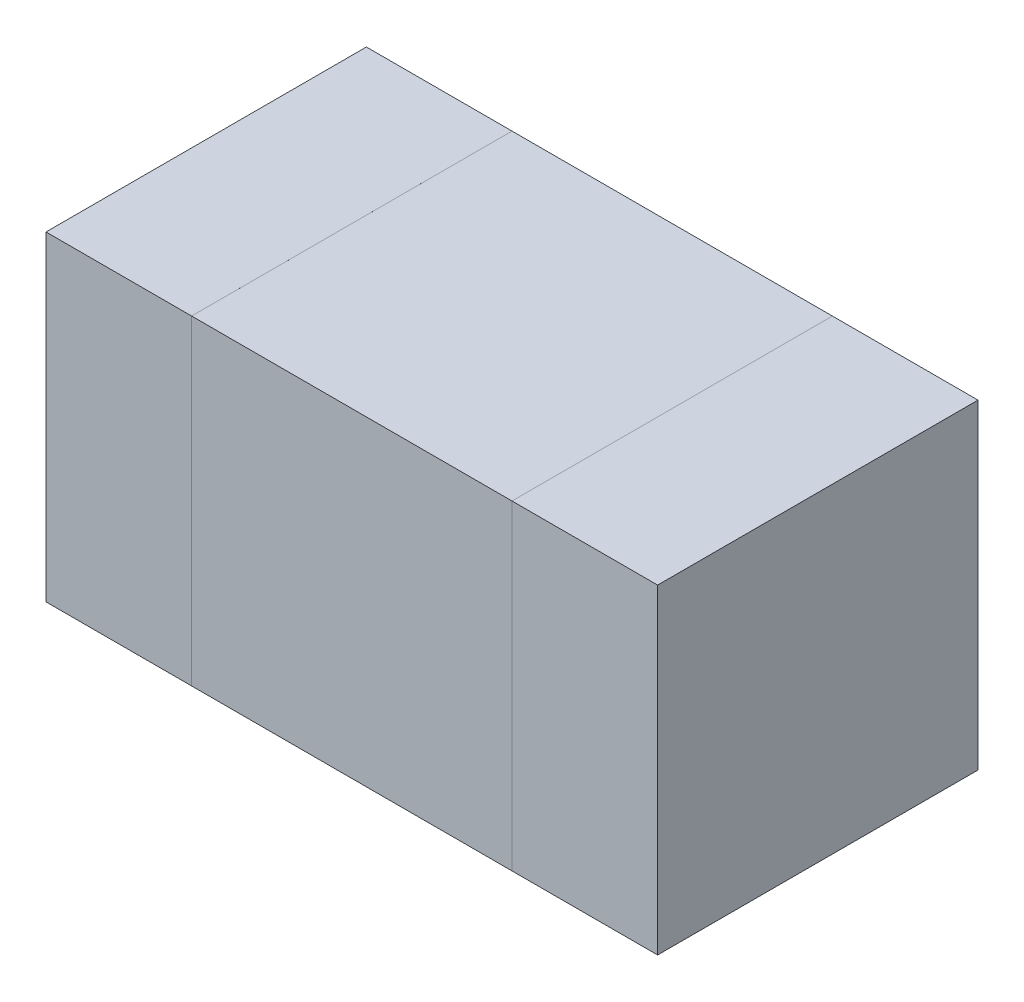
ISO-10303-21;
HEADER;
FILE_DESCRIPTION(('STEP AP214'),'2;1');
FILE_NAME('part.step','',(''),(''),'','','');
FILE_SCHEMA(('AUTOMOTIVE_DESIGN { 1 0 10303 214 1 1 1 1 }'));
ENDSEC;
DATA;
#1=APPLICATION_CONTEXT('core data for automotive mechanical design processes');
#2=APPLICATION_PROTOCOL_DEFINITION('international standard','automotive_design',2000,#1);
#3=PRODUCT_CONTEXT('',#1,'mechanical');
#4=PRODUCT('Part','Part','',(#3));
#5=PRODUCT_RELATED_PRODUCT_CATEGORY('part','',(#4));
#6=PRODUCT_DEFINITION_FORMATION('','',#4);
#7=PRODUCT_DEFINITION_CONTEXT('part definition',#1,'design');
#8=PRODUCT_DEFINITION('design','',#6,#7);
#9=PRODUCT_DEFINITION_SHAPE('','',#8);
#10=(LENGTH_UNIT() NAMED_UNIT(*) SI_UNIT(.MILLI.,.METRE.));
#11=(NAMED_UNIT(*) PLANE_ANGLE_UNIT() SI_UNIT($,.RADIAN.));
#12=(NAMED_UNIT(*) SI_UNIT($,.STERADIAN.) SOLID_ANGLE_UNIT());
#13=UNCERTAINTY_MEASURE_WITH_UNIT(LENGTH_MEASURE(1.E-05),#10,'distance_accuracy_value','');
#14=(GEOMETRIC_REPRESENTATION_CONTEXT(3) GLOBAL_UNCERTAINTY_ASSIGNED_CONTEXT((#13)) GLOBAL_UNIT_ASSIGNED_CONTEXT((#10,
#11,#12)) REPRESENTATION_CONTEXT('',''));
#15=CARTESIAN_POINT('',(0.,0.,0.));
#16=DIRECTION('',(0.,0.,1.));
#17=DIRECTION('',(1.,0.,0.));
#18=AXIS2_PLACEMENT_3D('',#15,#16,#17);
#19=CARTESIAN_POINT('',(9.010003181211,9.834998434316,0.32999934));
#20=DIRECTION('',(0.,0.,-1.));
#21=DIRECTION('',(0.,-1.,0.));
#22=AXIS2_PLACEMENT_3D('',#19,#20,#21);
#23=PLANE('',#22);
#24=DIRECTION('',(1.,0.,0.));
#25=VECTOR('',#24,1.);
#26=CARTESIAN_POINT('',(9.010003181211,9.834998434316,0.32999934));
#27=LINE('',#26,#25);
#28=CARTESIAN_POINT('',(9.010003181211,9.834998434316,0.32999934));
#29=VERTEX_POINT('',#28);
#30=CARTESIAN_POINT('',(9.340005061211,9.834998434316,0.32999934));
#31=VERTEX_POINT('',#30);
#32=EDGE_CURVE('P0_E82',#29,#31,#27,.T.);
#33=ORIENTED_EDGE('',*,*,#32,.T.);
#34=DIRECTION('',(0.,1.,0.));
#35=VECTOR('',#34,1.);
#36=CARTESIAN_POINT('',(9.340005061211,9.834998434316,0.32999934));
#37=LINE('',#36,#35);
#38=CARTESIAN_POINT('',(9.340005061211,10.164997774316,0.32999934));
#39=VERTEX_POINT('',#38);
#40=EDGE_CURVE('P0_E103',#31,#39,#37,.T.);
#41=ORIENTED_EDGE('',*,*,#40,.T.);
#42=DIRECTION('',(-1.,0.,0.));
#43=VECTOR('',#42,1.);
#44=CARTESIAN_POINT('',(9.340005061211,10.164997774316,0.32999934));
#45=LINE('',#44,#43);
#46=CARTESIAN_POINT('',(9.010003181211,10.164997774316,0.32999934));
#47=VERTEX_POINT('',#46);
#48=EDGE_CURVE('P0_E75',#39,#47,#45,.T.);
#49=ORIENTED_EDGE('',*,*,#48,.T.);
#50=DIRECTION('',(0.,-1.,0.));
#51=VECTOR('',#50,1.);
#52=CARTESIAN_POINT('',(9.010003181211,10.164997774316,0.32999934));
#53=LINE('',#52,#51);
#54=EDGE_CURVE('P0_E11',#47,#29,#53,.T.);
#55=ORIENTED_EDGE('',*,*,#54,.T.);
#56=EDGE_LOOP('',(#33,#41,#49,#55));
#57=FACE_BOUND('',#56,.T.);
#58=ADVANCED_FACE('P0_F17',(#57),#23,.F.);
#59=CARTESIAN_POINT('',(9.010003181211,9.834998434316,0.));
#60=DIRECTION('',(0.,0.,-1.));
#61=DIRECTION('',(0.,-1.,0.));
#62=AXIS2_PLACEMENT_3D('',#59,#60,#61);
#63=PLANE('',#62);
#64=DIRECTION('',(0.,-1.,0.));
#65=VECTOR('',#64,1.);
#66=CARTESIAN_POINT('',(9.010003181211,10.164997774316,0.));
#67=LINE('',#66,#65);
#68=CARTESIAN_POINT('',(9.010003181211,10.164997774316,0.));
#69=VERTEX_POINT('',#68);
#70=CARTESIAN_POINT('',(9.010003181211,9.834998434316,0.));
#71=VERTEX_POINT('',#70);
#72=EDGE_CURVE('P0_E26',#69,#71,#67,.T.);
#73=ORIENTED_EDGE('',*,*,#72,.F.);
#74=DIRECTION('',(-1.,0.,0.));
#75=VECTOR('',#74,1.);
#76=CARTESIAN_POINT('',(9.340005061211,10.164997774316,0.));
#77=LINE('',#76,#75);
#78=CARTESIAN_POINT('',(9.340005061211,10.164997774316,0.));
#79=VERTEX_POINT('',#78);
#80=EDGE_CURVE('P0_E106',#79,#69,#77,.T.);
#81=ORIENTED_EDGE('',*,*,#80,.F.);
#82=DIRECTION('',(0.,1.,0.));
#83=VECTOR('',#82,1.);
#84=CARTESIAN_POINT('',(9.340005061211,9.834998434316,0.));
#85=LINE('',#84,#83);
#86=CARTESIAN_POINT('',(9.340005061211,9.834998434316,0.));
#87=VERTEX_POINT('',#86);
#88=EDGE_CURVE('P0_E84',#87,#79,#85,.T.);
#89=ORIENTED_EDGE('',*,*,#88,.F.);
#90=DIRECTION('',(1.,0.,0.));
#91=VECTOR('',#90,1.);
#92=CARTESIAN_POINT('',(9.010003181211,9.834998434316,0.));
#93=LINE('',#92,#91);
#94=EDGE_CURVE('P0_E80',#71,#87,#93,.T.);
#95=ORIENTED_EDGE('',*,*,#94,.F.);
#96=EDGE_LOOP('',(#73,#81,#89,#95));
#97=FACE_BOUND('',#96,.T.);
#98=ADVANCED_FACE('P0_F19',(#97),#63,.T.);
#99=CARTESIAN_POINT('',(9.010003181211,10.164997774316,0.));
#100=DIRECTION('',(1.,0.,0.));
#101=DIRECTION('',(0.,1.,0.));
#102=AXIS2_PLACEMENT_3D('',#99,#100,#101);
#103=PLANE('',#102);
#104=ORIENTED_EDGE('',*,*,#72,.T.);
#105=DIRECTION('',(0.,0.,1.));
#106=VECTOR('',#105,1.);
#107=CARTESIAN_POINT('',(9.010003181211,9.834998434316,0.));
#108=LINE('',#107,#106);
#109=EDGE_CURVE('P0_E69',#71,#29,#108,.T.);
#110=ORIENTED_EDGE('',*,*,#109,.T.);
#111=ORIENTED_EDGE('',*,*,#54,.F.);
#112=DIRECTION('',(0.,0.,1.));
#113=VECTOR('',#112,1.);
#114=CARTESIAN_POINT('',(9.010003181211,10.164997774316,0.));
#115=LINE('',#114,#113);
#116=EDGE_CURVE('P0_E72',#69,#47,#115,.T.);
#117=ORIENTED_EDGE('',*,*,#116,.F.);
#118=EDGE_LOOP('',(#104,#110,#111,#117));
#119=FACE_BOUND('',#118,.T.);
#120=ADVANCED_FACE('P0_F68',(#119),#103,.F.);
#121=CARTESIAN_POINT('',(9.340005061211,10.164997774316,0.));
#122=DIRECTION('',(0.,-1.,0.));
#123=DIRECTION('',(0.,0.,-1.));
#124=AXIS2_PLACEMENT_3D('',#121,#122,#123);
#125=PLANE('',#124);
#126=ORIENTED_EDGE('',*,*,#80,.T.);
#127=ORIENTED_EDGE('',*,*,#116,.T.);
#128=ORIENTED_EDGE('',*,*,#48,.F.);
#129=DIRECTION('',(0.,0.,1.));
#130=VECTOR('',#129,1.);
#131=CARTESIAN_POINT('',(9.340005061211,10.164997774316,0.));
#132=LINE('',#131,#130);
#133=EDGE_CURVE('P0_E99',#79,#39,#132,.T.);
#134=ORIENTED_EDGE('',*,*,#133,.F.);
#135=EDGE_LOOP('',(#126,#127,#128,#134));
#136=FACE_BOUND('',#135,.T.);
#137=ADVANCED_FACE('P0_F116',(#136),#125,.F.);
#138=CARTESIAN_POINT('',(9.340005061211,9.834998434316,0.));
#139=DIRECTION('',(-1.,0.,0.));
#140=DIRECTION('',(0.,0.,1.));
#141=AXIS2_PLACEMENT_3D('',#138,#139,#140);
#142=PLANE('',#141);
#143=ORIENTED_EDGE('',*,*,#88,.T.);
#144=ORIENTED_EDGE('',*,*,#133,.T.);
#145=ORIENTED_EDGE('',*,*,#40,.F.);
#146=DIRECTION('',(0.,0.,1.));
#147=VECTOR('',#146,1.);
#148=CARTESIAN_POINT('',(9.340005061211,9.834998434316,0.));
#149=LINE('',#148,#147);
#150=EDGE_CURVE('P0_E89',#87,#31,#149,.T.);
#151=ORIENTED_EDGE('',*,*,#150,.F.);
#152=EDGE_LOOP('',(#143,#144,#145,#151));
#153=FACE_BOUND('',#152,.T.);
#154=ADVANCED_FACE('P0_F118',(#153),#142,.F.);
#155=CARTESIAN_POINT('',(9.010003181211,9.834998434316,0.));
#156=DIRECTION('',(0.,1.,0.));
#157=DIRECTION('',(1.,0.,0.));
#158=AXIS2_PLACEMENT_3D('',#155,#156,#157);
#159=PLANE('',#158);
#160=ORIENTED_EDGE('',*,*,#94,.T.);
#161=ORIENTED_EDGE('',*,*,#150,.T.);
#162=ORIENTED_EDGE('',*,*,#32,.F.);
#163=ORIENTED_EDGE('',*,*,#109,.F.);
#164=EDGE_LOOP('',(#160,#161,#162,#163));
#165=FACE_BOUND('',#164,.T.);
#166=ADVANCED_FACE('P0_F78',(#165),#159,.F.);
#167=CLOSED_SHELL('',(#58,#98,#120,#137,#154,#166));
#168=MANIFOLD_SOLID_BREP('P0_B1',#167);
#169=CARTESIAN_POINT('',(9.009999748047,9.834995894316,0.32999934));
#170=DIRECTION('',(0.,0.,-1.));
#171=DIRECTION('',(0.,-1.,0.));
#172=AXIS2_PLACEMENT_3D('',#169,#170,#171);
#173=PLANE('',#172);
#174=DIRECTION('',(0.,1.,0.));
#175=VECTOR('',#174,1.);
#176=CARTESIAN_POINT('',(9.009999748047,9.834995894316,0.32999934));
#177=LINE('',#176,#175);
#178=CARTESIAN_POINT('',(9.009999748047,9.834995894316,0.32999934));
#179=VERTEX_POINT('',#178);
#180=CARTESIAN_POINT('',(9.009999748047,10.164997774316,0.32999934));
#181=VERTEX_POINT('',#180);
#182=EDGE_CURVE('P1_E94',#179,#181,#177,.T.);
#183=ORIENTED_EDGE('',*,*,#182,.T.);
#184=DIRECTION('',(-1.,0.,0.));
#185=VECTOR('',#184,1.);
#186=CARTESIAN_POINT('',(9.009999748047,10.164997774316,0.32999934));
#187=LINE('',#186,#185);
#188=CARTESIAN_POINT('',(8.859997508047,10.164997774316,0.32999934));
#189=VERTEX_POINT('',#188);
#190=EDGE_CURVE('P1_E74',#181,#189,#187,.T.);
#191=ORIENTED_EDGE('',*,*,#190,.T.);
#192=DIRECTION('',(0.,-1.,0.));
#193=VECTOR('',#192,1.);
#194=CARTESIAN_POINT('',(8.859997508047,10.164997774316,0.32999934));
#195=LINE('',#194,#193);
#196=CARTESIAN_POINT('',(8.859997508047,9.834995894316,0.32999934));
#197=VERTEX_POINT('',#196);
#198=EDGE_CURVE('P1_E79',#189,#197,#195,.T.);
#199=ORIENTED_EDGE('',*,*,#198,.T.);
#200=DIRECTION('',(1.,0.,0.));
#201=VECTOR('',#200,1.);
#202=CARTESIAN_POINT('',(8.859997508047,9.834995894316,0.32999934));
#203=LINE('',#202,#201);
#204=EDGE_CURVE('P1_E11',#197,#179,#203,.T.);
#205=ORIENTED_EDGE('',*,*,#204,.T.);
#206=EDGE_LOOP('',(#183,#191,#199,#205));
#207=FACE_BOUND('',#206,.T.);
#208=ADVANCED_FACE('P1_F17',(#207),#173,.F.);
#209=CARTESIAN_POINT('',(9.009999748047,9.834995894316,0.));
#210=DIRECTION('',(0.,0.,-1.));
#211=DIRECTION('',(0.,-1.,0.));
#212=AXIS2_PLACEMENT_3D('',#209,#210,#211);
#213=PLANE('',#212);
#214=DIRECTION('',(1.,0.,0.));
#215=VECTOR('',#214,1.);
#216=CARTESIAN_POINT('',(8.859997508047,9.834995894316,0.));
#217=LINE('',#216,#215);
#218=CARTESIAN_POINT('',(8.859997508047,9.834995894316,0.));
#219=VERTEX_POINT('',#218);
#220=CARTESIAN_POINT('',(9.009999748047,9.834995894316,0.));
#221=VERTEX_POINT('',#220);
#222=EDGE_CURVE('P1_E26',#219,#221,#217,.T.);
#223=ORIENTED_EDGE('',*,*,#222,.F.);
#224=DIRECTION('',(0.,-1.,0.));
#225=VECTOR('',#224,1.);
#226=CARTESIAN_POINT('',(8.859997508047,10.164997774316,0.));
#227=LINE('',#226,#225);
#228=CARTESIAN_POINT('',(8.859997508047,10.164997774316,0.));
#229=VERTEX_POINT('',#228);
#230=EDGE_CURVE('P1_E62',#229,#219,#227,.T.);
#231=ORIENTED_EDGE('',*,*,#230,.F.);
#232=DIRECTION('',(-1.,0.,0.));
#233=VECTOR('',#232,1.);
#234=CARTESIAN_POINT('',(9.009999748047,10.164997774316,0.));
#235=LINE('',#234,#233);
#236=CARTESIAN_POINT('',(9.009999748047,10.164997774316,0.));
#237=VERTEX_POINT('',#236);
#238=EDGE_CURVE('P1_E67',#237,#229,#235,.T.);
#239=ORIENTED_EDGE('',*,*,#238,.F.);
#240=DIRECTION('',(0.,1.,0.));
#241=VECTOR('',#240,1.);
#242=CARTESIAN_POINT('',(9.009999748047,9.834995894316,0.));
#243=LINE('',#242,#241);
#244=EDGE_CURVE('P1_E112',#221,#237,#243,.T.);
#245=ORIENTED_EDGE('',*,*,#244,.F.);
#246=EDGE_LOOP('',(#223,#231,#239,#245));
#247=FACE_BOUND('',#246,.T.);
#248=ADVANCED_FACE('P1_F64',(#247),#213,.T.);
#249=CARTESIAN_POINT('',(8.859997508047,9.834995894316,0.));
#250=DIRECTION('',(0.,1.,0.));
#251=DIRECTION('',(1.,0.,0.));
#252=AXIS2_PLACEMENT_3D('',#249,#250,#251);
#253=PLANE('',#252);
#254=ORIENTED_EDGE('',*,*,#222,.T.);
#255=DIRECTION('',(0.,0.,1.));
#256=VECTOR('',#255,1.);
#257=CARTESIAN_POINT('',(9.009999748047,9.834995894316,0.));
#258=LINE('',#257,#256);
#259=EDGE_CURVE('P1_E89',#221,#179,#258,.T.);
#260=ORIENTED_EDGE('',*,*,#259,.T.);
#261=ORIENTED_EDGE('',*,*,#204,.F.);
#262=DIRECTION('',(0.,0.,1.));
#263=VECTOR('',#262,1.);
#264=CARTESIAN_POINT('',(8.859997508047,9.834995894316,0.));
#265=LINE('',#264,#263);
#266=EDGE_CURVE('P1_E73',#219,#197,#265,.T.);
#267=ORIENTED_EDGE('',*,*,#266,.F.);
#268=EDGE_LOOP('',(#254,#260,#261,#267));
#269=FACE_BOUND('',#268,.T.);
#270=ADVANCED_FACE('P1_F130',(#269),#253,.F.);
#271=CARTESIAN_POINT('',(8.859997508047,10.164997774316,0.));
#272=DIRECTION('',(1.,0.,0.));
#273=DIRECTION('',(0.,1.,0.));
#274=AXIS2_PLACEMENT_3D('',#271,#272,#273);
#275=PLANE('',#274);
#276=ORIENTED_EDGE('',*,*,#230,.T.);
#277=ORIENTED_EDGE('',*,*,#266,.T.);
#278=ORIENTED_EDGE('',*,*,#198,.F.);
#279=DIRECTION('',(0.,0.,1.));
#280=VECTOR('',#279,1.);
#281=CARTESIAN_POINT('',(8.859997508047,10.164997774316,0.));
#282=LINE('',#281,#280);
#283=EDGE_CURVE('P1_E77',#229,#189,#282,.T.);
#284=ORIENTED_EDGE('',*,*,#283,.F.);
#285=EDGE_LOOP('',(#276,#277,#278,#284));
#286=FACE_BOUND('',#285,.T.);
#287=ADVANCED_FACE('P1_F78',(#286),#275,.F.);
#288=CARTESIAN_POINT('',(9.009999748047,10.164997774316,0.));
#289=DIRECTION('',(0.,-1.,0.));
#290=DIRECTION('',(0.,0.,-1.));
#291=AXIS2_PLACEMENT_3D('',#288,#289,#290);
#292=PLANE('',#291);
#293=ORIENTED_EDGE('',*,*,#238,.T.);
#294=ORIENTED_EDGE('',*,*,#283,.T.);
#295=ORIENTED_EDGE('',*,*,#190,.F.);
#296=DIRECTION('',(0.,0.,1.));
#297=VECTOR('',#296,1.);
#298=CARTESIAN_POINT('',(9.009999748047,10.164997774316,0.));
#299=LINE('',#298,#297);
#300=EDGE_CURVE('P1_E86',#237,#181,#299,.T.);
#301=ORIENTED_EDGE('',*,*,#300,.F.);
#302=EDGE_LOOP('',(#293,#294,#295,#301));
#303=FACE_BOUND('',#302,.T.);
#304=ADVANCED_FACE('P1_F84',(#303),#292,.F.);
#305=CARTESIAN_POINT('',(9.009999748047,9.834995894316,0.));
#306=DIRECTION('',(-1.,0.,0.));
#307=DIRECTION('',(0.,0.,1.));
#308=AXIS2_PLACEMENT_3D('',#305,#306,#307);
#309=PLANE('',#308);
#310=ORIENTED_EDGE('',*,*,#244,.T.);
#311=ORIENTED_EDGE('',*,*,#300,.T.);
#312=ORIENTED_EDGE('',*,*,#182,.F.);
#313=ORIENTED_EDGE('',*,*,#259,.F.);
#314=EDGE_LOOP('',(#310,#311,#312,#313));
#315=FACE_BOUND('',#314,.T.);
#316=ADVANCED_FACE('P1_F118',(#315),#309,.F.);
#317=CLOSED_SHELL('',(#208,#248,#270,#287,#304,#316));
#318=MANIFOLD_SOLID_BREP('P1_B1',#317);
#319=CARTESIAN_POINT('',(9.489995475586,9.834995894316,0.32999934));
#320=DIRECTION('',(0.,0.,-1.));
#321=DIRECTION('',(0.,-1.,0.));
#322=AXIS2_PLACEMENT_3D('',#319,#320,#321);
#323=PLANE('',#322);
#324=DIRECTION('',(0.,1.,0.));
#325=VECTOR('',#324,1.);
#326=CARTESIAN_POINT('',(9.489995475586,9.834995894316,0.32999934));
#327=LINE('',#326,#325);
#328=CARTESIAN_POINT('',(9.489995475586,9.834995894316,0.32999934));
#329=VERTEX_POINT('',#328);
#330=CARTESIAN_POINT('',(9.489995475586,10.164997774316,0.32999934));
#331=VERTEX_POINT('',#330);
#332=EDGE_CURVE('P2_E85',#329,#331,#327,.T.);
#333=ORIENTED_EDGE('',*,*,#332,.T.);
#334=DIRECTION('',(-1.,0.,0.));
#335=VECTOR('',#334,1.);
#336=CARTESIAN_POINT('',(9.489995475586,10.164997774316,0.32999934));
#337=LINE('',#336,#335);
#338=CARTESIAN_POINT('',(9.339993235586,10.164997774316,0.32999934));
#339=VERTEX_POINT('',#338);
#340=EDGE_CURVE('P2_E71',#331,#339,#337,.T.);
#341=ORIENTED_EDGE('',*,*,#340,.T.);
#342=DIRECTION('',(0.,-1.,0.));
#343=VECTOR('',#342,1.);
#344=CARTESIAN_POINT('',(9.339993235586,10.164997774316,0.32999934));
#345=LINE('',#344,#343);
#346=CARTESIAN_POINT('',(9.339993235586,9.834995894316,0.32999934));
#347=VERTEX_POINT('',#346);
#348=EDGE_CURVE('P2_E112',#339,#347,#345,.T.);
#349=ORIENTED_EDGE('',*,*,#348,.T.);
#350=DIRECTION('',(1.,0.,0.));
#351=VECTOR('',#350,1.);
#352=CARTESIAN_POINT('',(9.339993235586,9.834995894316,0.32999934));
#353=LINE('',#352,#351);
#354=EDGE_CURVE('P2_E11',#347,#329,#353,.T.);
#355=ORIENTED_EDGE('',*,*,#354,.T.);
#356=EDGE_LOOP('',(#333,#341,#349,#355));
#357=FACE_BOUND('',#356,.T.);
#358=ADVANCED_FACE('P2_F17',(#357),#323,.F.);
#359=CARTESIAN_POINT('',(9.489995475586,9.834995894316,0.));
#360=DIRECTION('',(0.,0.,-1.));
#361=DIRECTION('',(0.,-1.,0.));
#362=AXIS2_PLACEMENT_3D('',#359,#360,#361);
#363=PLANE('',#362);
#364=DIRECTION('',(1.,0.,0.));
#365=VECTOR('',#364,1.);
#366=CARTESIAN_POINT('',(9.339993235586,9.834995894316,0.));
#367=LINE('',#366,#365);
#368=CARTESIAN_POINT('',(9.339993235586,9.834995894316,0.));
#369=VERTEX_POINT('',#368);
#370=CARTESIAN_POINT('',(9.489995475586,9.834995894316,0.));
#371=VERTEX_POINT('',#370);
#372=EDGE_CURVE('P2_E20',#369,#371,#367,.T.);
#373=ORIENTED_EDGE('',*,*,#372,.F.);
#374=DIRECTION('',(0.,-1.,0.));
#375=VECTOR('',#374,1.);
#376=CARTESIAN_POINT('',(9.339993235586,10.164997774316,0.));
#377=LINE('',#376,#375);
#378=CARTESIAN_POINT('',(9.339993235586,10.164997774316,0.));
#379=VERTEX_POINT('',#378);
#380=EDGE_CURVE('P2_E82',#379,#369,#377,.T.);
#381=ORIENTED_EDGE('',*,*,#380,.F.);
#382=DIRECTION('',(-1.,0.,0.));
#383=VECTOR('',#382,1.);
#384=CARTESIAN_POINT('',(9.489995475586,10.164997774316,0.));
#385=LINE('',#384,#383);
#386=CARTESIAN_POINT('',(9.489995475586,10.164997774316,0.));
#387=VERTEX_POINT('',#386);
#388=EDGE_CURVE('P2_E101',#387,#379,#385,.T.);
#389=ORIENTED_EDGE('',*,*,#388,.F.);
#390=DIRECTION('',(0.,1.,0.));
#391=VECTOR('',#390,1.);
#392=CARTESIAN_POINT('',(9.489995475586,9.834995894316,0.));
#393=LINE('',#392,#391);
#394=EDGE_CURVE('P2_E92',#371,#387,#393,.T.);
#395=ORIENTED_EDGE('',*,*,#394,.F.);
#396=EDGE_LOOP('',(#373,#381,#389,#395));
#397=FACE_BOUND('',#396,.T.);
#398=ADVANCED_FACE('P2_F119',(#397),#363,.T.);
#399=CARTESIAN_POINT('',(9.339993235586,9.834995894316,0.));
#400=DIRECTION('',(0.,1.,0.));
#401=DIRECTION('',(1.,0.,0.));
#402=AXIS2_PLACEMENT_3D('',#399,#400,#401);
#403=PLANE('',#402);
#404=ORIENTED_EDGE('',*,*,#372,.T.);
#405=DIRECTION('',(0.,0.,1.));
#406=VECTOR('',#405,1.);
#407=CARTESIAN_POINT('',(9.489995475586,9.834995894316,0.));
#408=LINE('',#407,#406);
#409=EDGE_CURVE('P2_E89',#371,#329,#408,.T.);
#410=ORIENTED_EDGE('',*,*,#409,.T.);
#411=ORIENTED_EDGE('',*,*,#354,.F.);
#412=DIRECTION('',(0.,0.,1.));
#413=VECTOR('',#412,1.);
#414=CARTESIAN_POINT('',(9.339993235586,9.834995894316,0.));
#415=LINE('',#414,#413);
#416=EDGE_CURVE('P2_E109',#369,#347,#415,.T.);
#417=ORIENTED_EDGE('',*,*,#416,.F.);
#418=EDGE_LOOP('',(#404,#410,#411,#417));
#419=FACE_BOUND('',#418,.T.);
#420=ADVANCED_FACE('P2_F118',(#419),#403,.F.);
#421=CARTESIAN_POINT('',(9.339993235586,10.164997774316,0.));
#422=DIRECTION('',(1.,0.,0.));
#423=DIRECTION('',(0.,1.,0.));
#424=AXIS2_PLACEMENT_3D('',#421,#422,#423);
#425=PLANE('',#424);
#426=ORIENTED_EDGE('',*,*,#380,.T.);
#427=ORIENTED_EDGE('',*,*,#416,.T.);
#428=ORIENTED_EDGE('',*,*,#348,.F.);
#429=DIRECTION('',(0.,0.,1.));
#430=VECTOR('',#429,1.);
#431=CARTESIAN_POINT('',(9.339993235586,10.164997774316,0.));
#432=LINE('',#431,#430);
#433=EDGE_CURVE('P2_E79',#379,#339,#432,.T.);
#434=ORIENTED_EDGE('',*,*,#433,.F.);
#435=EDGE_LOOP('',(#426,#427,#428,#434));
#436=FACE_BOUND('',#435,.T.);
#437=ADVANCED_FACE('P2_F121',(#436),#425,.F.);
#438=CARTESIAN_POINT('',(9.489995475586,10.164997774316,0.));
#439=DIRECTION('',(0.,-1.,0.));
#440=DIRECTION('',(0.,0.,-1.));
#441=AXIS2_PLACEMENT_3D('',#438,#439,#440);
#442=PLANE('',#441);
#443=ORIENTED_EDGE('',*,*,#388,.T.);
#444=ORIENTED_EDGE('',*,*,#433,.T.);
#445=ORIENTED_EDGE('',*,*,#340,.F.);
#446=DIRECTION('',(0.,0.,1.));
#447=VECTOR('',#446,1.);
#448=CARTESIAN_POINT('',(9.489995475586,10.164997774316,0.));
#449=LINE('',#448,#447);
#450=EDGE_CURVE('P2_E76',#387,#331,#449,.T.);
#451=ORIENTED_EDGE('',*,*,#450,.F.);
#452=EDGE_LOOP('',(#443,#444,#445,#451));
#453=FACE_BOUND('',#452,.T.);
#454=ADVANCED_FACE('P2_F74',(#453),#442,.F.);
#455=CARTESIAN_POINT('',(9.489995475586,9.834995894316,0.));
#456=DIRECTION('',(-1.,0.,0.));
#457=DIRECTION('',(0.,0.,1.));
#458=AXIS2_PLACEMENT_3D('',#455,#456,#457);
#459=PLANE('',#458);
#460=ORIENTED_EDGE('',*,*,#394,.T.);
#461=ORIENTED_EDGE('',*,*,#450,.T.);
#462=ORIENTED_EDGE('',*,*,#332,.F.);
#463=ORIENTED_EDGE('',*,*,#409,.F.);
#464=EDGE_LOOP('',(#460,#461,#462,#463));
#465=FACE_BOUND('',#464,.T.);
#466=ADVANCED_FACE('P2_F91',(#465),#459,.F.);
#467=CLOSED_SHELL('',(#358,#398,#420,#437,#454,#466));
#468=MANIFOLD_SOLID_BREP('P2_B1',#467);
#469=ADVANCED_BREP_SHAPE_REPRESENTATION('',(#18,#168,#318,#468),#14);
#470=SHAPE_DEFINITION_REPRESENTATION(#9,#469);
ENDSEC;
END-ISO-10303-21;
